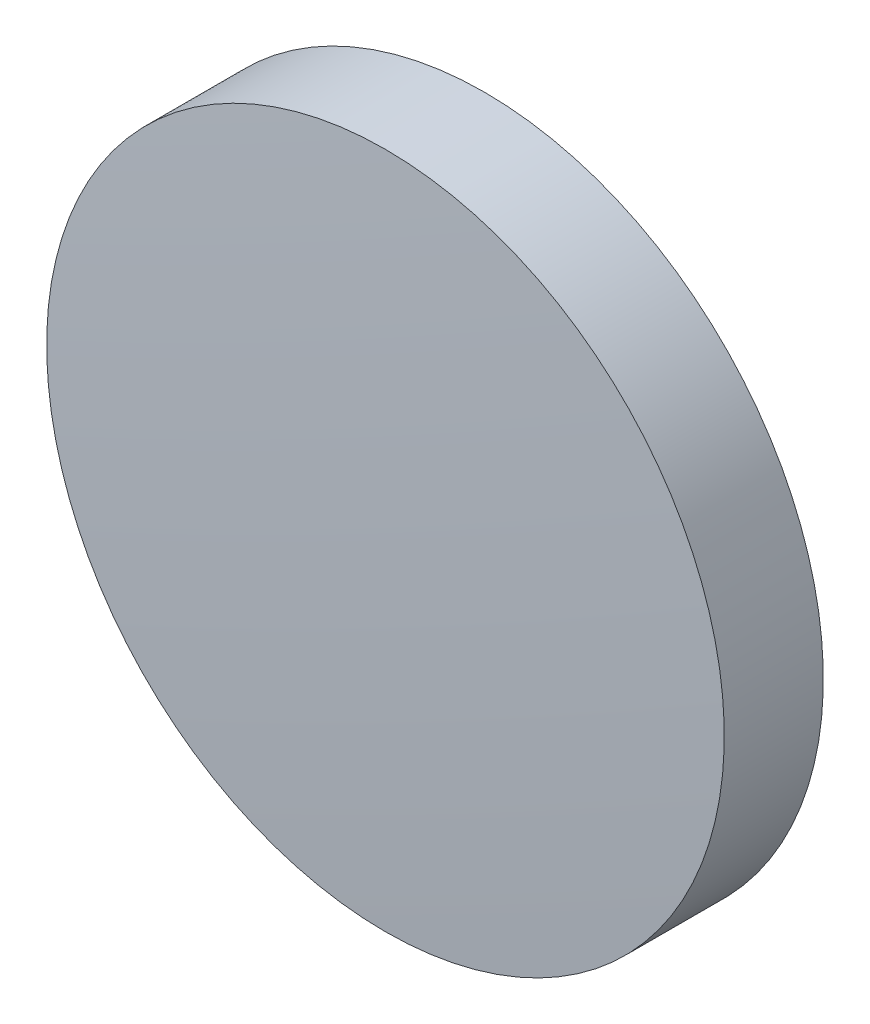
ISO-10303-21;
HEADER;
FILE_DESCRIPTION(('STEP AP214'),'2;1');
FILE_NAME('part.step','',(''),(''),'','','');
FILE_SCHEMA(('AUTOMOTIVE_DESIGN { 1 0 10303 214 1 1 1 1 }'));
ENDSEC;
DATA;
#1=APPLICATION_CONTEXT('core data for automotive mechanical design processes');
#2=APPLICATION_PROTOCOL_DEFINITION('international standard','automotive_design',2000,#1);
#3=PRODUCT_CONTEXT('',#1,'mechanical');
#4=PRODUCT('Part','Part','',(#3));
#5=PRODUCT_RELATED_PRODUCT_CATEGORY('part','',(#4));
#6=PRODUCT_DEFINITION_FORMATION('','',#4);
#7=PRODUCT_DEFINITION_CONTEXT('part definition',#1,'design');
#8=PRODUCT_DEFINITION('design','',#6,#7);
#9=PRODUCT_DEFINITION_SHAPE('','',#8);
#10=(LENGTH_UNIT() NAMED_UNIT(*) SI_UNIT(.MILLI.,.METRE.));
#11=(NAMED_UNIT(*) PLANE_ANGLE_UNIT() SI_UNIT($,.RADIAN.));
#12=(NAMED_UNIT(*) SI_UNIT($,.STERADIAN.) SOLID_ANGLE_UNIT());
#13=UNCERTAINTY_MEASURE_WITH_UNIT(LENGTH_MEASURE(1.E-05),#10,'distance_accuracy_value','');
#14=(GEOMETRIC_REPRESENTATION_CONTEXT(3) GLOBAL_UNCERTAINTY_ASSIGNED_CONTEXT((#13)) GLOBAL_UNIT_ASSIGNED_CONTEXT((#10,
#11,#12)) REPRESENTATION_CONTEXT('',''));
#15=CARTESIAN_POINT('',(0.,0.,0.));
#16=DIRECTION('',(0.,0.,1.));
#17=DIRECTION('',(1.,0.,0.));
#18=AXIS2_PLACEMENT_3D('',#15,#16,#17);
#19=CARTESIAN_POINT('',(0.,0.,-2.));
#20=DIRECTION('',(0.,0.,-1.));
#21=DIRECTION('',(0.,1.,0.));
#22=AXIS2_PLACEMENT_3D('',#19,#20,#21);
#23=PLANE('',#22);
#24=CARTESIAN_POINT('',(0.,0.,-2.));
#25=DIRECTION('',(0.,0.,-1.));
#26=DIRECTION('',(0.,1.,0.));
#27=AXIS2_PLACEMENT_3D('',#24,#25,#26);
#28=CIRCLE('',#27,12.7);
#29=CARTESIAN_POINT('',(0.,12.7,-2.));
#30=VERTEX_POINT('',#29);
#31=EDGE_CURVE('E36',#30,#30,#28,.T.);
#32=ORIENTED_EDGE('',*,*,#31,.T.);
#33=EDGE_LOOP('',(#32));
#34=FACE_BOUND('',#33,.T.);
#35=ADVANCED_FACE('F30',(#34),#23,.T.);
#36=CARTESIAN_POINT('',(0.,0.,-278.5));
#37=DIRECTION('',(0.,0.,-1.));
#38=DIRECTION('',(0.,1.,0.));
#39=AXIS2_PLACEMENT_3D('',#36,#37,#38);
#40=SPHERICAL_SURFACE('',#39,280.5);
#41=CARTESIAN_POINT('',(0.,0.,1.71234805054532));
#42=DIRECTION('',(0.,0.,-1.));
#43=DIRECTION('',(0.,1.,0.));
#44=AXIS2_PLACEMENT_3D('',#41,#42,#43);
#45=CIRCLE('',#44,12.7);
#46=CARTESIAN_POINT('',(0.,12.7,1.71234805054532));
#47=VERTEX_POINT('',#46);
#48=EDGE_CURVE('E10',#47,#47,#45,.T.);
#49=ORIENTED_EDGE('',*,*,#48,.F.);
#50=EDGE_LOOP('',(#49));
#51=FACE_BOUND('',#50,.T.);
#52=ADVANCED_FACE('F45',(#51),#40,.T.);
#53=CARTESIAN_POINT('',(0.,0.,-2.));
#54=DIRECTION('',(0.,0.,-1.));
#55=DIRECTION('',(0.,1.,0.));
#56=AXIS2_PLACEMENT_3D('',#53,#54,#55);
#57=CYLINDRICAL_SURFACE('',#56,12.7);
#58=ORIENTED_EDGE('',*,*,#48,.T.);
#59=EDGE_LOOP('',(#58));
#60=FACE_BOUND('',#59,.T.);
#61=ORIENTED_EDGE('',*,*,#31,.F.);
#62=EDGE_LOOP('',(#61));
#63=FACE_BOUND('',#62,.T.);
#64=ADVANCED_FACE('F43',(#60,#63),#57,.T.);
#65=CLOSED_SHELL('',(#35,#52,#64));
#66=MANIFOLD_SOLID_BREP('B2',#65);
#67=ADVANCED_BREP_SHAPE_REPRESENTATION('',(#18,#66),#14);
#68=SHAPE_DEFINITION_REPRESENTATION(#9,#67);
ENDSEC;
END-ISO-10303-21;
